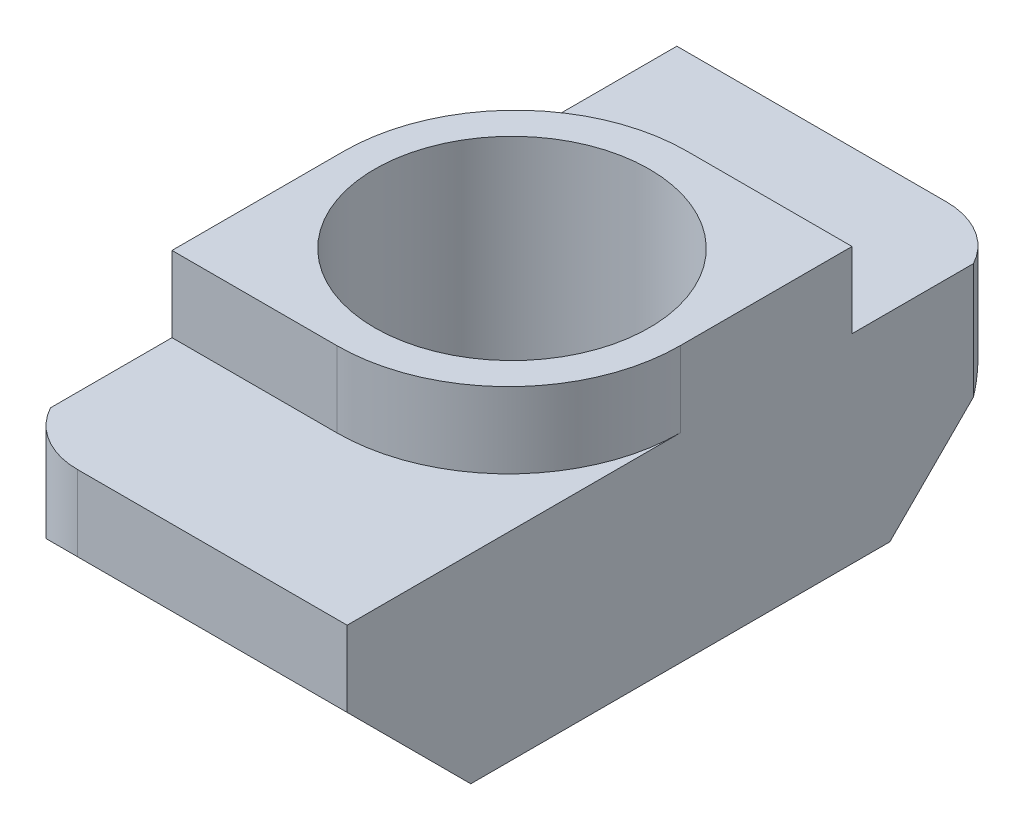
ISO-10303-21;
HEADER;
FILE_DESCRIPTION(('STEP AP214'),'2;1');
FILE_NAME('part.step','',(''),(''),'','','');
FILE_SCHEMA(('AUTOMOTIVE_DESIGN { 1 0 10303 214 1 1 1 1 }'));
ENDSEC;
DATA;
#1=APPLICATION_CONTEXT('core data for automotive mechanical design processes');
#2=APPLICATION_PROTOCOL_DEFINITION('international standard','automotive_design',2000,#1);
#3=PRODUCT_CONTEXT('',#1,'mechanical');
#4=PRODUCT('Part','Part','',(#3));
#5=PRODUCT_RELATED_PRODUCT_CATEGORY('part','',(#4));
#6=PRODUCT_DEFINITION_FORMATION('','',#4);
#7=PRODUCT_DEFINITION_CONTEXT('part definition',#1,'design');
#8=PRODUCT_DEFINITION('design','',#6,#7);
#9=PRODUCT_DEFINITION_SHAPE('','',#8);
#10=(LENGTH_UNIT() NAMED_UNIT(*) SI_UNIT(.MILLI.,.METRE.));
#11=(NAMED_UNIT(*) PLANE_ANGLE_UNIT() SI_UNIT($,.RADIAN.));
#12=(NAMED_UNIT(*) SI_UNIT($,.STERADIAN.) SOLID_ANGLE_UNIT());
#13=UNCERTAINTY_MEASURE_WITH_UNIT(LENGTH_MEASURE(1.E-05),#10,'distance_accuracy_value','');
#14=(GEOMETRIC_REPRESENTATION_CONTEXT(3) GLOBAL_UNCERTAINTY_ASSIGNED_CONTEXT((#13)) GLOBAL_UNIT_ASSIGNED_CONTEXT((#10,
#11,#12)) REPRESENTATION_CONTEXT('',''));
#15=CARTESIAN_POINT('',(0.,0.,0.));
#16=DIRECTION('',(0.,0.,1.));
#17=DIRECTION('',(1.,0.,0.));
#18=AXIS2_PLACEMENT_3D('',#15,#16,#17);
#19=CARTESIAN_POINT('',(2.952255458229,-2.2,-7.4884));
#20=DIRECTION('',(0.,1.,0.));
#21=DIRECTION('',(0.,0.,1.));
#22=AXIS2_PLACEMENT_3D('',#19,#20,#21);
#23=CYLINDRICAL_SURFACE('',#22,2.2116);
#24=DIRECTION('',(0.,1.,0.));
#25=VECTOR('',#24,1.);
#26=CARTESIAN_POINT('',(4.9,0.,-8.536));
#27=LINE('',#26,#25);
#28=CARTESIAN_POINT('',(4.9,-5.5639999999997,-8.5360000000003));
#29=VERTEX_POINT('',#28);
#30=CARTESIAN_POINT('',(4.9,-2.2,-8.5360000000003));
#31=VERTEX_POINT('',#30);
#32=EDGE_CURVE('E203',#29,#31,#27,.T.);
#33=ORIENTED_EDGE('',*,*,#32,.F.);
#34=CARTESIAN_POINT('',(2.952255458229,-6.6116,-7.4884));
#35=DIRECTION('',(0.,-0.707106781186548,-0.707106781186548));
#36=DIRECTION('',(0.,0.707106781186548,-0.707106781186548));
#37=AXIS2_PLACEMENT_3D('',#34,#35,#36);
#38=ELLIPSE('',#37,3.12767471454434,2.2116);
#39=CARTESIAN_POINT('',(2.952255458229,-4.4,-9.7));
#40=VERTEX_POINT('',#39);
#41=EDGE_CURVE('E89',#40,#29,#38,.T.);
#42=ORIENTED_EDGE('',*,*,#41,.F.);
#43=DIRECTION('',(0.,1.,0.));
#44=VECTOR('',#43,1.);
#45=CARTESIAN_POINT('',(2.952255458229,-4.4,-9.7));
#46=LINE('',#45,#44);
#47=CARTESIAN_POINT('',(2.952255458229,-2.2,-9.7));
#48=VERTEX_POINT('',#47);
#49=EDGE_CURVE('E82',#48,#40,#46,.F.);
#50=ORIENTED_EDGE('',*,*,#49,.F.);
#51=CARTESIAN_POINT('',(2.952255458229,-2.2,-7.4884));
#52=DIRECTION('',(0.,1.,0.));
#53=DIRECTION('',(0.,0.,1.));
#54=AXIS2_PLACEMENT_3D('',#51,#52,#53);
#55=CIRCLE('',#54,2.2116);
#56=EDGE_CURVE('E163',#31,#48,#55,.T.);
#57=ORIENTED_EDGE('',*,*,#56,.F.);
#58=EDGE_LOOP('',(#33,#42,#50,#57));
#59=FACE_BOUND('',#58,.T.);
#60=ADVANCED_FACE('F16',(#59),#23,.T.);
#61=CARTESIAN_POINT('',(-4.9,-2.2,-5.));
#62=DIRECTION('',(0.,0.,-1.));
#63=DIRECTION('',(-1.,0.,0.));
#64=AXIS2_PLACEMENT_3D('',#61,#62,#63);
#65=PLANE('',#64);
#66=DIRECTION('',(0.,1.,0.));
#67=VECTOR('',#66,1.);
#68=CARTESIAN_POINT('',(4.9,0.,-5.));
#69=LINE('',#68,#67);
#70=CARTESIAN_POINT('',(4.9,-2.2,-5.));
#71=VERTEX_POINT('',#70);
#72=CARTESIAN_POINT('',(4.9,0.,-5.));
#73=VERTEX_POINT('',#72);
#74=EDGE_CURVE('E196',#71,#73,#69,.T.);
#75=ORIENTED_EDGE('',*,*,#74,.F.);
#76=DIRECTION('',(1.,0.,0.));
#77=VECTOR('',#76,1.);
#78=CARTESIAN_POINT('',(-4.9,-2.2,-5.));
#79=LINE('',#78,#77);
#80=CARTESIAN_POINT('',(0.1,-2.2,-5.));
#81=VERTEX_POINT('',#80);
#82=EDGE_CURVE('E222',#81,#71,#79,.T.);
#83=ORIENTED_EDGE('',*,*,#82,.F.);
#84=DIRECTION('',(0.,1.,0.));
#85=VECTOR('',#84,1.);
#86=CARTESIAN_POINT('',(0.100000000000001,0.,-5.));
#87=LINE('',#86,#85);
#88=CARTESIAN_POINT('',(0.1,0.,-5.));
#89=VERTEX_POINT('',#88);
#90=EDGE_CURVE('E162',#89,#81,#87,.F.);
#91=ORIENTED_EDGE('',*,*,#90,.F.);
#92=DIRECTION('',(1.,0.,0.));
#93=VECTOR('',#92,1.);
#94=CARTESIAN_POINT('',(-4.9,0.,-5.));
#95=LINE('',#94,#93);
#96=EDGE_CURVE('E155',#73,#89,#95,.F.);
#97=ORIENTED_EDGE('',*,*,#96,.F.);
#98=EDGE_LOOP('',(#75,#83,#91,#97));
#99=FACE_BOUND('',#98,.T.);
#100=ADVANCED_FACE('F417',(#99),#65,.T.);
#101=CARTESIAN_POINT('',(0.,0.,0.));
#102=DIRECTION('',(0.,1.,0.));
#103=DIRECTION('',(0.,0.,1.));
#104=AXIS2_PLACEMENT_3D('',#101,#102,#103);
#105=CYLINDRICAL_SURFACE('',#104,4.);
#106=CARTESIAN_POINT('',(0.,0.,0.));
#107=DIRECTION('',(0.,1.,0.));
#108=DIRECTION('',(0.,0.,1.));
#109=AXIS2_PLACEMENT_3D('',#106,#107,#108);
#110=CIRCLE('',#109,4.);
#111=CARTESIAN_POINT('',(0.,0.,4.));
#112=VERTEX_POINT('',#111);
#113=EDGE_CURVE('E149',#112,#112,#110,.F.);
#114=ORIENTED_EDGE('',*,*,#113,.F.);
#115=EDGE_LOOP('',(#114));
#116=FACE_BOUND('',#115,.T.);
#117=CARTESIAN_POINT('',(0.,-8.,0.));
#118=DIRECTION('',(0.,1.,0.));
#119=DIRECTION('',(0.,0.,1.));
#120=AXIS2_PLACEMENT_3D('',#117,#118,#119);
#121=CIRCLE('',#120,4.);
#122=CARTESIAN_POINT('',(0.,-8.,4.));
#123=VERTEX_POINT('',#122);
#124=EDGE_CURVE('E20',#123,#123,#121,.T.);
#125=ORIENTED_EDGE('',*,*,#124,.F.);
#126=EDGE_LOOP('',(#125));
#127=FACE_BOUND('',#126,.T.);
#128=ADVANCED_FACE('F410',(#116,#127),#105,.F.);
#129=CARTESIAN_POINT('',(4.9,0.,0.));
#130=DIRECTION('',(1.,0.,0.));
#131=DIRECTION('',(0.,0.,-1.));
#132=AXIS2_PLACEMENT_3D('',#129,#130,#131);
#133=PLANE('',#132);
#134=DIRECTION('',(0.,0.,-1.));
#135=VECTOR('',#134,1.);
#136=CARTESIAN_POINT('',(4.9,-8.,6.1));
#137=LINE('',#136,#135);
#138=CARTESIAN_POINT('',(4.9,-8.,-6.1));
#139=VERTEX_POINT('',#138);
#140=CARTESIAN_POINT('',(4.9,-8.,6.1));
#141=VERTEX_POINT('',#140);
#142=EDGE_CURVE('E98',#139,#141,#137,.F.);
#143=ORIENTED_EDGE('',*,*,#142,.F.);
#144=DIRECTION('',(0.,0.707106781186548,-0.707106781186548));
#145=VECTOR('',#144,1.);
#146=CARTESIAN_POINT('',(4.9,-8.,-6.1));
#147=LINE('',#146,#145);
#148=EDGE_CURVE('E166',#29,#139,#147,.F.);
#149=ORIENTED_EDGE('',*,*,#148,.F.);
#150=ORIENTED_EDGE('',*,*,#32,.T.);
#151=DIRECTION('',(0.,0.,1.));
#152=VECTOR('',#151,1.);
#153=CARTESIAN_POINT('',(4.9,-2.2,5.));
#154=LINE('',#153,#152);
#155=EDGE_CURVE('E165',#71,#31,#154,.F.);
#156=ORIENTED_EDGE('',*,*,#155,.F.);
#157=ORIENTED_EDGE('',*,*,#74,.T.);
#158=DIRECTION('',(0.,0.,1.));
#159=VECTOR('',#158,1.);
#160=CARTESIAN_POINT('',(4.9,0.,-5.));
#161=LINE('',#160,#159);
#162=CARTESIAN_POINT('',(4.9,0.,0.));
#163=VERTEX_POINT('',#162);
#164=EDGE_CURVE('E159',#163,#73,#161,.F.);
#165=ORIENTED_EDGE('',*,*,#164,.F.);
#166=DIRECTION('',(0.,1.,0.));
#167=VECTOR('',#166,1.);
#168=CARTESIAN_POINT('',(4.9,0.,0.));
#169=LINE('',#168,#167);
#170=CARTESIAN_POINT('',(4.9,-2.2,0.));
#171=VERTEX_POINT('',#170);
#172=EDGE_CURVE('E194',#171,#163,#169,.T.);
#173=ORIENTED_EDGE('',*,*,#172,.F.);
#174=DIRECTION('',(0.,0.,1.));
#175=VECTOR('',#174,1.);
#176=CARTESIAN_POINT('',(4.9,-2.2,5.));
#177=LINE('',#176,#175);
#178=CARTESIAN_POINT('',(4.9,-2.2,9.7));
#179=VERTEX_POINT('',#178);
#180=EDGE_CURVE('E136',#179,#171,#177,.F.);
#181=ORIENTED_EDGE('',*,*,#180,.F.);
#182=DIRECTION('',(0.,1.,0.));
#183=VECTOR('',#182,1.);
#184=CARTESIAN_POINT('',(4.9,-2.2,9.7));
#185=LINE('',#184,#183);
#186=CARTESIAN_POINT('',(4.9,-4.4,9.7));
#187=VERTEX_POINT('',#186);
#188=EDGE_CURVE('E133',#187,#179,#185,.T.);
#189=ORIENTED_EDGE('',*,*,#188,.F.);
#190=DIRECTION('',(0.,-0.707106781186548,-0.707106781186548));
#191=VECTOR('',#190,1.);
#192=CARTESIAN_POINT('',(4.9,-4.4,9.7));
#193=LINE('',#192,#191);
#194=EDGE_CURVE('E198',#141,#187,#193,.F.);
#195=ORIENTED_EDGE('',*,*,#194,.F.);
#196=EDGE_LOOP('',(#143,#149,#150,#156,#157,#165,#173,#181,#189,#195));
#197=FACE_BOUND('',#196,.T.);
#198=ADVANCED_FACE('F402',(#197),#133,.T.);
#199=CARTESIAN_POINT('',(-0.1,0.,0.));
#200=DIRECTION('',(0.,1.,0.));
#201=DIRECTION('',(0.,0.,1.));
#202=AXIS2_PLACEMENT_3D('',#199,#200,#201);
#203=CYLINDRICAL_SURFACE('',#202,5.);
#204=CARTESIAN_POINT('',(-0.1,-2.2,0.));
#205=DIRECTION('',(0.,1.,0.));
#206=DIRECTION('',(0.,0.,1.));
#207=AXIS2_PLACEMENT_3D('',#204,#205,#206);
#208=CIRCLE('',#207,5.);
#209=CARTESIAN_POINT('',(-0.1,-2.2,5.));
#210=VERTEX_POINT('',#209);
#211=EDGE_CURVE('E147',#171,#210,#208,.F.);
#212=ORIENTED_EDGE('',*,*,#211,.F.);
#213=ORIENTED_EDGE('',*,*,#172,.T.);
#214=CARTESIAN_POINT('',(-0.1,0.,0.));
#215=DIRECTION('',(0.,1.,0.));
#216=DIRECTION('',(0.,0.,1.));
#217=AXIS2_PLACEMENT_3D('',#214,#215,#216);
#218=CIRCLE('',#217,5.);
#219=CARTESIAN_POINT('',(-0.1,0.,5.));
#220=VERTEX_POINT('',#219);
#221=EDGE_CURVE('E156',#220,#163,#218,.T.);
#222=ORIENTED_EDGE('',*,*,#221,.F.);
#223=DIRECTION('',(0.,1.,0.));
#224=VECTOR('',#223,1.);
#225=CARTESIAN_POINT('',(-0.1,0.,5.));
#226=LINE('',#225,#224);
#227=EDGE_CURVE('E152',#210,#220,#226,.T.);
#228=ORIENTED_EDGE('',*,*,#227,.F.);
#229=EDGE_LOOP('',(#212,#213,#222,#228));
#230=FACE_BOUND('',#229,.T.);
#231=ADVANCED_FACE('F395',(#230),#203,.T.);
#232=CARTESIAN_POINT('',(-4.9,-2.2,9.7));
#233=DIRECTION('',(0.,0.,1.));
#234=DIRECTION('',(1.,0.,0.));
#235=AXIS2_PLACEMENT_3D('',#232,#233,#234);
#236=PLANE('',#235);
#237=ORIENTED_EDGE('',*,*,#188,.T.);
#238=DIRECTION('',(1.,0.,0.));
#239=VECTOR('',#238,1.);
#240=CARTESIAN_POINT('',(-4.9,-2.2,9.7));
#241=LINE('',#240,#239);
#242=CARTESIAN_POINT('',(-2.952255458229,-2.2,9.7));
#243=VERTEX_POINT('',#242);
#244=EDGE_CURVE('E130',#243,#179,#241,.T.);
#245=ORIENTED_EDGE('',*,*,#244,.F.);
#246=DIRECTION('',(0.,1.,0.));
#247=VECTOR('',#246,1.);
#248=CARTESIAN_POINT('',(-2.952255458229,-2.2,9.7));
#249=LINE('',#248,#247);
#250=CARTESIAN_POINT('',(-2.952255458229,-4.4,9.7));
#251=VERTEX_POINT('',#250);
#252=EDGE_CURVE('E122',#251,#243,#249,.T.);
#253=ORIENTED_EDGE('',*,*,#252,.F.);
#254=DIRECTION('',(1.,0.,0.));
#255=VECTOR('',#254,1.);
#256=CARTESIAN_POINT('',(-4.9,-4.4,9.7));
#257=LINE('',#256,#255);
#258=EDGE_CURVE('E119',#187,#251,#257,.F.);
#259=ORIENTED_EDGE('',*,*,#258,.F.);
#260=EDGE_LOOP('',(#237,#245,#253,#259));
#261=FACE_BOUND('',#260,.T.);
#262=ADVANCED_FACE('F131',(#261),#236,.T.);
#263=CARTESIAN_POINT('',(-4.9,-4.4,9.7));
#264=DIRECTION('',(0.,-0.707106781186548,0.707106781186548));
#265=DIRECTION('',(0.,-0.707106781186548,-0.707106781186548));
#266=AXIS2_PLACEMENT_3D('',#263,#264,#265);
#267=PLANE('',#266);
#268=CARTESIAN_POINT('',(-2.952255458229,-6.6116,7.4884));
#269=DIRECTION('',(0.,-0.707106781186548,0.707106781186548));
#270=DIRECTION('',(0.,0.707106781186548,0.707106781186548));
#271=AXIS2_PLACEMENT_3D('',#268,#269,#270);
#272=ELLIPSE('',#271,3.12767471454434,2.2116);
#273=CARTESIAN_POINT('',(-4.9,-5.5639999999997,8.5360000000003));
#274=VERTEX_POINT('',#273);
#275=EDGE_CURVE('E125',#274,#251,#272,.F.);
#276=ORIENTED_EDGE('',*,*,#275,.F.);
#277=DIRECTION('',(0.,-0.707106781186547,-0.707106781186548));
#278=VECTOR('',#277,1.);
#279=CARTESIAN_POINT('',(-4.9,-5.564,8.536));
#280=LINE('',#279,#278);
#281=CARTESIAN_POINT('',(-4.9,-8.,6.1));
#282=VERTEX_POINT('',#281);
#283=EDGE_CURVE('E143',#274,#282,#280,.T.);
#284=ORIENTED_EDGE('',*,*,#283,.T.);
#285=DIRECTION('',(1.,0.,0.));
#286=VECTOR('',#285,1.);
#287=CARTESIAN_POINT('',(-4.9,-8.,6.1));
#288=LINE('',#287,#286);
#289=EDGE_CURVE('E176',#141,#282,#288,.F.);
#290=ORIENTED_EDGE('',*,*,#289,.F.);
#291=ORIENTED_EDGE('',*,*,#194,.T.);
#292=ORIENTED_EDGE('',*,*,#258,.T.);
#293=EDGE_LOOP('',(#276,#284,#290,#291,#292));
#294=FACE_BOUND('',#293,.T.);
#295=ADVANCED_FACE('F293',(#294),#267,.T.);
#296=CARTESIAN_POINT('',(-4.9,-8.,6.1));
#297=DIRECTION('',(0.,-1.,0.));
#298=DIRECTION('',(0.,0.,-1.));
#299=AXIS2_PLACEMENT_3D('',#296,#297,#298);
#300=PLANE('',#299);
#301=ORIENTED_EDGE('',*,*,#124,.T.);
#302=EDGE_LOOP('',(#301));
#303=FACE_BOUND('',#302,.T.);
#304=ORIENTED_EDGE('',*,*,#289,.T.);
#305=DIRECTION('',(0.,0.,-1.));
#306=VECTOR('',#305,1.);
#307=CARTESIAN_POINT('',(-4.9,-8.,0.));
#308=LINE('',#307,#306);
#309=CARTESIAN_POINT('',(-4.9,-8.,-6.1));
#310=VERTEX_POINT('',#309);
#311=EDGE_CURVE('E183',#282,#310,#308,.T.);
#312=ORIENTED_EDGE('',*,*,#311,.T.);
#313=DIRECTION('',(1.,0.,0.));
#314=VECTOR('',#313,1.);
#315=CARTESIAN_POINT('',(-4.9,-8.,-6.1));
#316=LINE('',#315,#314);
#317=EDGE_CURVE('E167',#139,#310,#316,.F.);
#318=ORIENTED_EDGE('',*,*,#317,.F.);
#319=ORIENTED_EDGE('',*,*,#142,.T.);
#320=EDGE_LOOP('',(#304,#312,#318,#319));
#321=FACE_BOUND('',#320,.T.);
#322=ADVANCED_FACE('F292',(#303,#321),#300,.T.);
#323=CARTESIAN_POINT('',(-4.9,-8.,-6.1));
#324=DIRECTION('',(0.,-0.707106781186548,-0.707106781186548));
#325=DIRECTION('',(0.,0.707106781186548,-0.707106781186548));
#326=AXIS2_PLACEMENT_3D('',#323,#324,#325);
#327=PLANE('',#326);
#328=ORIENTED_EDGE('',*,*,#41,.T.);
#329=ORIENTED_EDGE('',*,*,#148,.T.);
#330=ORIENTED_EDGE('',*,*,#317,.T.);
#331=DIRECTION('',(0.,0.707106781186547,-0.707106781186548));
#332=VECTOR('',#331,1.);
#333=CARTESIAN_POINT('',(-4.9,-8.,-6.1));
#334=LINE('',#333,#332);
#335=CARTESIAN_POINT('',(-4.9,-4.4,-9.7));
#336=VERTEX_POINT('',#335);
#337=EDGE_CURVE('E186',#310,#336,#334,.T.);
#338=ORIENTED_EDGE('',*,*,#337,.T.);
#339=DIRECTION('',(-1.,0.,0.));
#340=VECTOR('',#339,1.);
#341=CARTESIAN_POINT('',(-4.9,-4.4,-9.7));
#342=LINE('',#341,#340);
#343=EDGE_CURVE('E208',#40,#336,#342,.T.);
#344=ORIENTED_EDGE('',*,*,#343,.F.);
#345=EDGE_LOOP('',(#328,#329,#330,#338,#344));
#346=FACE_BOUND('',#345,.T.);
#347=ADVANCED_FACE('F285',(#346),#327,.T.);
#348=CARTESIAN_POINT('',(-4.9,-4.4,-9.7));
#349=DIRECTION('',(0.,0.,-1.));
#350=DIRECTION('',(-1.,0.,0.));
#351=AXIS2_PLACEMENT_3D('',#348,#349,#350);
#352=PLANE('',#351);
#353=DIRECTION('',(0.,1.,0.));
#354=VECTOR('',#353,1.);
#355=CARTESIAN_POINT('',(-4.9,0.,-9.7));
#356=LINE('',#355,#354);
#357=CARTESIAN_POINT('',(-4.9,-2.2,-9.7));
#358=VERTEX_POINT('',#357);
#359=EDGE_CURVE('E275',#336,#358,#356,.T.);
#360=ORIENTED_EDGE('',*,*,#359,.T.);
#361=DIRECTION('',(1.,0.,0.));
#362=VECTOR('',#361,1.);
#363=CARTESIAN_POINT('',(-4.9,-2.2,-9.7));
#364=LINE('',#363,#362);
#365=EDGE_CURVE('E226',#48,#358,#364,.F.);
#366=ORIENTED_EDGE('',*,*,#365,.F.);
#367=ORIENTED_EDGE('',*,*,#49,.T.);
#368=ORIENTED_EDGE('',*,*,#343,.T.);
#369=EDGE_LOOP('',(#360,#366,#367,#368));
#370=FACE_BOUND('',#369,.T.);
#371=ADVANCED_FACE('F317',(#370),#352,.T.);
#372=CARTESIAN_POINT('',(-4.9,-2.2,5.));
#373=DIRECTION('',(0.,1.,0.));
#374=DIRECTION('',(0.,0.,1.));
#375=AXIS2_PLACEMENT_3D('',#372,#373,#374);
#376=PLANE('',#375);
#377=ORIENTED_EDGE('',*,*,#155,.T.);
#378=ORIENTED_EDGE('',*,*,#56,.T.);
#379=ORIENTED_EDGE('',*,*,#365,.T.);
#380=DIRECTION('',(0.,0.,-1.));
#381=VECTOR('',#380,1.);
#382=CARTESIAN_POINT('',(-4.9,-2.2,0.));
#383=LINE('',#382,#381);
#384=CARTESIAN_POINT('',(-4.9,-2.2,0.));
#385=VERTEX_POINT('',#384);
#386=EDGE_CURVE('E272',#358,#385,#383,.F.);
#387=ORIENTED_EDGE('',*,*,#386,.T.);
#388=CARTESIAN_POINT('',(0.1,-2.2,0.));
#389=DIRECTION('',(0.,1.,0.));
#390=DIRECTION('',(0.,0.,1.));
#391=AXIS2_PLACEMENT_3D('',#388,#389,#390);
#392=CIRCLE('',#391,5.);
#393=EDGE_CURVE('E160',#81,#385,#392,.T.);
#394=ORIENTED_EDGE('',*,*,#393,.F.);
#395=ORIENTED_EDGE('',*,*,#82,.T.);
#396=EDGE_LOOP('',(#377,#378,#379,#387,#394,#395));
#397=FACE_BOUND('',#396,.T.);
#398=ADVANCED_FACE('F314',(#397),#376,.T.);
#399=CARTESIAN_POINT('',(0.1,0.,0.));
#400=DIRECTION('',(0.,1.,0.));
#401=DIRECTION('',(0.,0.,1.));
#402=AXIS2_PLACEMENT_3D('',#399,#400,#401);
#403=CYLINDRICAL_SURFACE('',#402,5.);
#404=ORIENTED_EDGE('',*,*,#393,.T.);
#405=DIRECTION('',(0.,1.,0.));
#406=VECTOR('',#405,1.);
#407=CARTESIAN_POINT('',(-4.9,0.,0.));
#408=LINE('',#407,#406);
#409=CARTESIAN_POINT('',(-4.9,0.,0.));
#410=VERTEX_POINT('',#409);
#411=EDGE_CURVE('E267',#385,#410,#408,.T.);
#412=ORIENTED_EDGE('',*,*,#411,.T.);
#413=CARTESIAN_POINT('',(0.1,0.,0.));
#414=DIRECTION('',(0.,1.,0.));
#415=DIRECTION('',(0.,0.,1.));
#416=AXIS2_PLACEMENT_3D('',#413,#414,#415);
#417=CIRCLE('',#416,5.);
#418=EDGE_CURVE('E153',#89,#410,#417,.T.);
#419=ORIENTED_EDGE('',*,*,#418,.F.);
#420=ORIENTED_EDGE('',*,*,#90,.T.);
#421=EDGE_LOOP('',(#404,#412,#419,#420));
#422=FACE_BOUND('',#421,.T.);
#423=ADVANCED_FACE('F309',(#422),#403,.T.);
#424=CARTESIAN_POINT('',(-4.9,0.,-5.));
#425=DIRECTION('',(0.,1.,0.));
#426=DIRECTION('',(0.,0.,1.));
#427=AXIS2_PLACEMENT_3D('',#424,#425,#426);
#428=PLANE('',#427);
#429=ORIENTED_EDGE('',*,*,#113,.T.);
#430=EDGE_LOOP('',(#429));
#431=FACE_BOUND('',#430,.T.);
#432=ORIENTED_EDGE('',*,*,#96,.T.);
#433=ORIENTED_EDGE('',*,*,#418,.T.);
#434=DIRECTION('',(0.,0.,-1.));
#435=VECTOR('',#434,1.);
#436=CARTESIAN_POINT('',(-4.9,0.,0.));
#437=LINE('',#436,#435);
#438=CARTESIAN_POINT('',(-4.9,0.,5.));
#439=VERTEX_POINT('',#438);
#440=EDGE_CURVE('E258',#410,#439,#437,.F.);
#441=ORIENTED_EDGE('',*,*,#440,.T.);
#442=DIRECTION('',(1.,0.,0.));
#443=VECTOR('',#442,1.);
#444=CARTESIAN_POINT('',(-4.9,0.,5.));
#445=LINE('',#444,#443);
#446=EDGE_CURVE('E137',#220,#439,#445,.F.);
#447=ORIENTED_EDGE('',*,*,#446,.F.);
#448=ORIENTED_EDGE('',*,*,#221,.T.);
#449=ORIENTED_EDGE('',*,*,#164,.T.);
#450=EDGE_LOOP('',(#432,#433,#441,#447,#448,#449));
#451=FACE_BOUND('',#450,.T.);
#452=ADVANCED_FACE('F304',(#431,#451),#428,.T.);
#453=CARTESIAN_POINT('',(-4.9,0.,5.));
#454=DIRECTION('',(0.,0.,1.));
#455=DIRECTION('',(1.,0.,0.));
#456=AXIS2_PLACEMENT_3D('',#453,#454,#455);
#457=PLANE('',#456);
#458=ORIENTED_EDGE('',*,*,#227,.T.);
#459=ORIENTED_EDGE('',*,*,#446,.T.);
#460=DIRECTION('',(0.,1.,0.));
#461=VECTOR('',#460,1.);
#462=CARTESIAN_POINT('',(-4.9,0.,5.));
#463=LINE('',#462,#461);
#464=CARTESIAN_POINT('',(-4.9,-2.2,5.));
#465=VERTEX_POINT('',#464);
#466=EDGE_CURVE('E253',#439,#465,#463,.F.);
#467=ORIENTED_EDGE('',*,*,#466,.T.);
#468=DIRECTION('',(1.,0.,0.));
#469=VECTOR('',#468,1.);
#470=CARTESIAN_POINT('',(-4.9,-2.2,5.));
#471=LINE('',#470,#469);
#472=EDGE_CURVE('E127',#210,#465,#471,.F.);
#473=ORIENTED_EDGE('',*,*,#472,.F.);
#474=EDGE_LOOP('',(#458,#459,#467,#473));
#475=FACE_BOUND('',#474,.T.);
#476=ADVANCED_FACE('F298',(#475),#457,.T.);
#477=CARTESIAN_POINT('',(-4.9,-2.2,5.));
#478=DIRECTION('',(0.,1.,0.));
#479=DIRECTION('',(0.,0.,1.));
#480=AXIS2_PLACEMENT_3D('',#477,#478,#479);
#481=PLANE('',#480);
#482=DIRECTION('',(0.,0.,-1.));
#483=VECTOR('',#482,1.);
#484=CARTESIAN_POINT('',(-4.9,-2.2,0.));
#485=LINE('',#484,#483);
#486=CARTESIAN_POINT('',(-4.9,-2.2,8.5360000000003));
#487=VERTEX_POINT('',#486);
#488=EDGE_CURVE('E26',#465,#487,#485,.F.);
#489=ORIENTED_EDGE('',*,*,#488,.T.);
#490=CARTESIAN_POINT('',(-2.952255458229,-2.2,7.4884));
#491=DIRECTION('',(0.,1.,0.));
#492=DIRECTION('',(0.,0.,1.));
#493=AXIS2_PLACEMENT_3D('',#490,#491,#492);
#494=CIRCLE('',#493,2.2116);
#495=EDGE_CURVE('E34',#243,#487,#494,.F.);
#496=ORIENTED_EDGE('',*,*,#495,.F.);
#497=ORIENTED_EDGE('',*,*,#244,.T.);
#498=ORIENTED_EDGE('',*,*,#180,.T.);
#499=ORIENTED_EDGE('',*,*,#211,.T.);
#500=ORIENTED_EDGE('',*,*,#472,.T.);
#501=EDGE_LOOP('',(#489,#496,#497,#498,#499,#500));
#502=FACE_BOUND('',#501,.T.);
#503=ADVANCED_FACE('F140',(#502),#481,.T.);
#504=CARTESIAN_POINT('',(-2.952255458229,-2.2,7.4884));
#505=DIRECTION('',(0.,1.,0.));
#506=DIRECTION('',(0.,0.,1.));
#507=AXIS2_PLACEMENT_3D('',#504,#505,#506);
#508=CYLINDRICAL_SURFACE('',#507,2.2116);
#509=DIRECTION('',(0.,1.,0.));
#510=VECTOR('',#509,1.);
#511=CARTESIAN_POINT('',(-4.9,0.,8.536));
#512=LINE('',#511,#510);
#513=EDGE_CURVE('E11',#487,#274,#512,.F.);
#514=ORIENTED_EDGE('',*,*,#513,.T.);
#515=ORIENTED_EDGE('',*,*,#275,.T.);
#516=ORIENTED_EDGE('',*,*,#252,.T.);
#517=ORIENTED_EDGE('',*,*,#495,.T.);
#518=EDGE_LOOP('',(#514,#515,#516,#517));
#519=FACE_BOUND('',#518,.T.);
#520=ADVANCED_FACE('F124',(#519),#508,.T.);
#521=CARTESIAN_POINT('',(-4.9,0.,0.));
#522=DIRECTION('',(1.,0.,0.));
#523=DIRECTION('',(0.,0.,-1.));
#524=AXIS2_PLACEMENT_3D('',#521,#522,#523);
#525=PLANE('',#524);
#526=ORIENTED_EDGE('',*,*,#488,.F.);
#527=ORIENTED_EDGE('',*,*,#466,.F.);
#528=ORIENTED_EDGE('',*,*,#440,.F.);
#529=ORIENTED_EDGE('',*,*,#411,.F.);
#530=ORIENTED_EDGE('',*,*,#386,.F.);
#531=ORIENTED_EDGE('',*,*,#359,.F.);
#532=ORIENTED_EDGE('',*,*,#337,.F.);
#533=ORIENTED_EDGE('',*,*,#311,.F.);
#534=ORIENTED_EDGE('',*,*,#283,.F.);
#535=ORIENTED_EDGE('',*,*,#513,.F.);
#536=EDGE_LOOP('',(#526,#527,#528,#529,#530,#531,#532,#533,#534,#535));
#537=FACE_BOUND('',#536,.T.);
#538=ADVANCED_FACE('F18',(#537),#525,.F.);
#539=CLOSED_SHELL('',(#60,#100,#128,#198,#231,#262,#295,#322,#347,#371,#398,#423,#452,#476,#503,
#520,#538));
#540=MANIFOLD_SOLID_BREP('B1',#539);
#541=ADVANCED_BREP_SHAPE_REPRESENTATION('',(#18,#540),#14);
#542=SHAPE_DEFINITION_REPRESENTATION(#9,#541);
ENDSEC;
END-ISO-10303-21;
